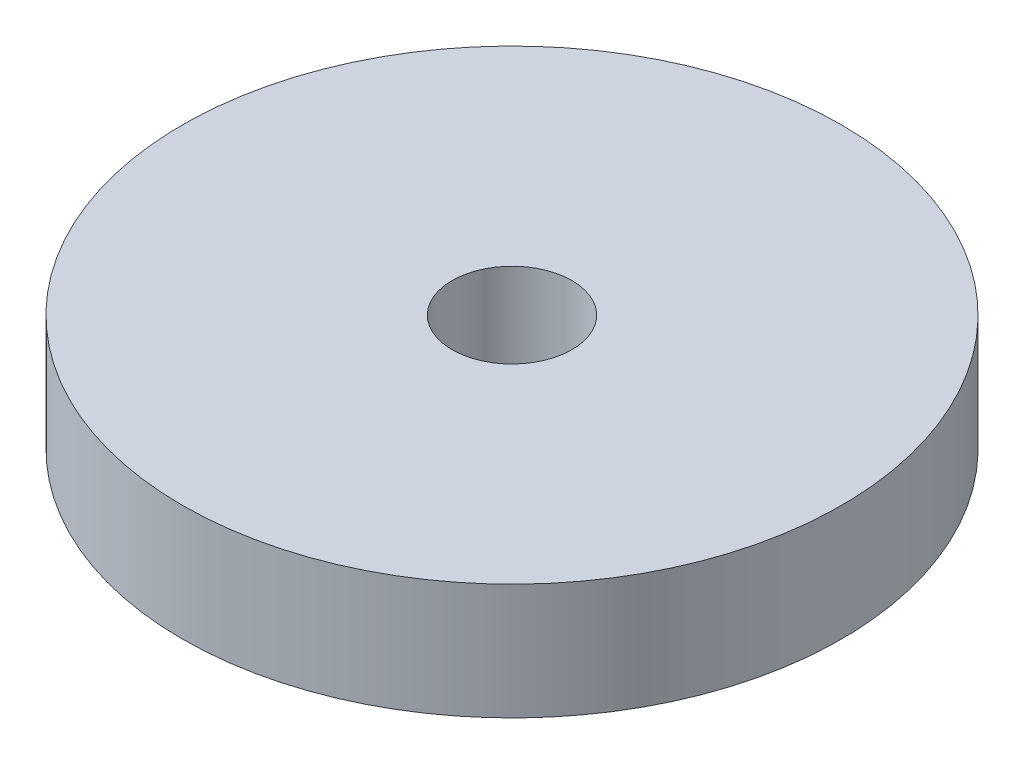
ISO-10303-21;
HEADER;
FILE_DESCRIPTION(('STEP AP214'),'2;1');
FILE_NAME('part.step','',(''),(''),'','','');
FILE_SCHEMA(('AUTOMOTIVE_DESIGN { 1 0 10303 214 1 1 1 1 }'));
ENDSEC;
DATA;
#1=APPLICATION_CONTEXT('core data for automotive mechanical design processes');
#2=APPLICATION_PROTOCOL_DEFINITION('international standard','automotive_design',2000,#1);
#3=PRODUCT_CONTEXT('',#1,'mechanical');
#4=PRODUCT('Part','Part','',(#3));
#5=PRODUCT_RELATED_PRODUCT_CATEGORY('part','',(#4));
#6=PRODUCT_DEFINITION_FORMATION('','',#4);
#7=PRODUCT_DEFINITION_CONTEXT('part definition',#1,'design');
#8=PRODUCT_DEFINITION('design','',#6,#7);
#9=PRODUCT_DEFINITION_SHAPE('','',#8);
#10=(LENGTH_UNIT() NAMED_UNIT(*) SI_UNIT(.MILLI.,.METRE.));
#11=(NAMED_UNIT(*) PLANE_ANGLE_UNIT() SI_UNIT($,.RADIAN.));
#12=(NAMED_UNIT(*) SI_UNIT($,.STERADIAN.) SOLID_ANGLE_UNIT());
#13=UNCERTAINTY_MEASURE_WITH_UNIT(LENGTH_MEASURE(1.E-05),#10,'distance_accuracy_value','');
#14=(GEOMETRIC_REPRESENTATION_CONTEXT(3) GLOBAL_UNCERTAINTY_ASSIGNED_CONTEXT((#13)) GLOBAL_UNIT_ASSIGNED_CONTEXT((#10,
#11,#12)) REPRESENTATION_CONTEXT('',''));
#15=CARTESIAN_POINT('',(0.,0.,0.));
#16=DIRECTION('',(0.,0.,1.));
#17=DIRECTION('',(1.,0.,0.));
#18=AXIS2_PLACEMENT_3D('',#15,#16,#17);
#19=CARTESIAN_POINT('',(0.,29.,0.));
#20=DIRECTION('',(0.,-1.,0.));
#21=DIRECTION('',(0.,0.,-1.));
#22=AXIS2_PLACEMENT_3D('',#19,#20,#21);
#23=CYLINDRICAL_SURFACE('',#22,82.5);
#24=CARTESIAN_POINT('',(0.,29.,0.));
#25=DIRECTION('',(0.,1.,0.));
#26=DIRECTION('',(0.,0.,1.));
#27=AXIS2_PLACEMENT_3D('',#24,#25,#26);
#28=CIRCLE('',#27,82.5);
#29=CARTESIAN_POINT('',(0.,29.,-82.5));
#30=VERTEX_POINT('',#29);
#31=EDGE_CURVE('E10',#30,#30,#28,.T.);
#32=CARTESIAN_POINT('',(0.,0.,0.));
#33=DIRECTION('',(0.,1.,0.));
#34=DIRECTION('',(0.,0.,1.));
#35=AXIS2_PLACEMENT_3D('',#32,#33,#34);
#36=CIRCLE('',#35,82.5);
#37=CARTESIAN_POINT('',(0.,0.,-82.5));
#38=VERTEX_POINT('',#37);
#39=EDGE_CURVE('E37',#38,#38,#36,.T.);
#40=CARTESIAN_POINT('',(0.,29.,-82.5));
#41=CARTESIAN_POINT('',(0.,28.6979166666667,-82.5));
#42=CARTESIAN_POINT('',(0.,28.3958333333333,-82.5));
#43=CARTESIAN_POINT('',(0.,27.7916666666667,-82.5));
#44=CARTESIAN_POINT('',(0.,27.4895833333333,-82.5));
#45=CARTESIAN_POINT('',(0.,26.8854166666667,-82.5));
#46=CARTESIAN_POINT('',(0.,26.5833333333333,-82.5));
#47=CARTESIAN_POINT('',(0.,25.9791666666667,-82.5));
#48=CARTESIAN_POINT('',(0.,25.6770833333333,-82.5));
#49=CARTESIAN_POINT('',(0.,25.0729166666667,-82.5));
#50=CARTESIAN_POINT('',(0.,24.7708333333333,-82.5));
#51=CARTESIAN_POINT('',(0.,24.1666666666667,-82.5));
#52=CARTESIAN_POINT('',(0.,23.8645833333333,-82.5));
#53=CARTESIAN_POINT('',(0.,23.2604166666667,-82.5));
#54=CARTESIAN_POINT('',(0.,22.9583333333333,-82.5));
#55=CARTESIAN_POINT('',(0.,22.3541666666667,-82.5));
#56=CARTESIAN_POINT('',(0.,22.0520833333333,-82.5));
#57=CARTESIAN_POINT('',(0.,21.4479166666667,-82.5));
#58=CARTESIAN_POINT('',(0.,21.1458333333333,-82.5));
#59=CARTESIAN_POINT('',(0.,20.5416666666667,-82.5));
#60=CARTESIAN_POINT('',(0.,20.2395833333333,-82.5));
#61=CARTESIAN_POINT('',(0.,19.6354166666667,-82.5));
#62=CARTESIAN_POINT('',(0.,19.3333333333333,-82.5));
#63=CARTESIAN_POINT('',(0.,18.7291666666667,-82.5));
#64=CARTESIAN_POINT('',(0.,18.4270833333333,-82.5));
#65=CARTESIAN_POINT('',(0.,17.8229166666667,-82.5));
#66=CARTESIAN_POINT('',(0.,17.5208333333333,-82.5));
#67=CARTESIAN_POINT('',(0.,16.9166666666667,-82.5));
#68=CARTESIAN_POINT('',(0.,16.6145833333333,-82.5));
#69=CARTESIAN_POINT('',(0.,16.0104166666667,-82.5));
#70=CARTESIAN_POINT('',(0.,15.7083333333333,-82.5));
#71=CARTESIAN_POINT('',(0.,15.1041666666667,-82.5));
#72=CARTESIAN_POINT('',(0.,14.8020833333333,-82.5));
#73=CARTESIAN_POINT('',(0.,14.1979166666667,-82.5));
#74=CARTESIAN_POINT('',(0.,13.8958333333333,-82.5));
#75=CARTESIAN_POINT('',(0.,13.2916666666667,-82.5));
#76=CARTESIAN_POINT('',(0.,12.9895833333333,-82.5));
#77=CARTESIAN_POINT('',(0.,12.3854166666667,-82.5));
#78=CARTESIAN_POINT('',(0.,12.0833333333333,-82.5));
#79=CARTESIAN_POINT('',(0.,11.4791666666667,-82.5));
#80=CARTESIAN_POINT('',(0.,11.1770833333333,-82.5));
#81=CARTESIAN_POINT('',(0.,10.5729166666667,-82.5));
#82=CARTESIAN_POINT('',(0.,10.2708333333333,-82.5));
#83=CARTESIAN_POINT('',(0.,9.66666666666667,-82.5));
#84=CARTESIAN_POINT('',(0.,9.36458333333333,-82.5));
#85=CARTESIAN_POINT('',(0.,8.76041666666667,-82.5));
#86=CARTESIAN_POINT('',(0.,8.45833333333333,-82.5));
#87=CARTESIAN_POINT('',(0.,7.85416666666667,-82.5));
#88=CARTESIAN_POINT('',(0.,7.55208333333333,-82.5));
#89=CARTESIAN_POINT('',(0.,6.94791666666667,-82.5));
#90=CARTESIAN_POINT('',(0.,6.64583333333333,-82.5));
#91=CARTESIAN_POINT('',(0.,6.04166666666667,-82.5));
#92=CARTESIAN_POINT('',(0.,5.73958333333333,-82.5));
#93=CARTESIAN_POINT('',(0.,5.13541666666667,-82.5));
#94=CARTESIAN_POINT('',(0.,4.83333333333333,-82.5));
#95=CARTESIAN_POINT('',(0.,4.22916666666667,-82.5));
#96=CARTESIAN_POINT('',(0.,3.92708333333333,-82.5));
#97=CARTESIAN_POINT('',(0.,3.32291666666667,-82.5));
#98=CARTESIAN_POINT('',(0.,3.02083333333333,-82.5));
#99=CARTESIAN_POINT('',(0.,2.41666666666667,-82.5));
#100=CARTESIAN_POINT('',(0.,2.11458333333333,-82.5));
#101=CARTESIAN_POINT('',(0.,1.51041666666667,-82.5));
#102=CARTESIAN_POINT('',(0.,1.20833333333333,-82.5));
#103=CARTESIAN_POINT('',(0.,0.604166666666667,-82.5));
#104=CARTESIAN_POINT('',(0.,0.302083333333333,-82.5));
#105=CARTESIAN_POINT('',(0.,0.,-82.5));
#106=B_SPLINE_CURVE_WITH_KNOTS('',3,(#40,#41,#42,#43,#44,#45,#46,#47,#48,#49,#50,#51,#52,#53,
#54,#55,#56,#57,#58,#59,#60,#61,#62,#63,#64,#65,#66,#67,#68,#69,#70,#71,#72,#73,#74,#75,#76,#77,
#78,#79,#80,#81,#82,#83,#84,#85,#86,#87,#88,#89,#90,#91,#92,#93,#94,#95,#96,#97,#98,#99,#100,
#101,#102,#103,#104,#105),.UNSPECIFIED.,.F.,.F.,(4,2,2,2,2,2,2,2,2,2,2,2,2,2,2,2,2,2,2,2,2,2,2,
2,2,2,2,2,2,2,2,2,4),(0.,0.906249999999997,1.8125,2.71875,3.625,4.53125,5.4375,6.34375,7.25,
8.15625,9.0625,9.96875,10.875,11.78125,12.6875,13.59375,14.5,15.40625,16.3125,17.21875,18.125,
19.03125,19.9375,20.84375,21.75,22.65625,23.5625,24.46875,25.375,26.28125,27.1875,28.09375,29.),.UNSPECIFIED.);
#107=EDGE_CURVE('BSEAM40',#30,#38,#106,.T.);
#108=ORIENTED_EDGE('',*,*,#31,.F.);
#109=ORIENTED_EDGE('',*,*,#39,.T.);
#110=ORIENTED_EDGE('',*,*,#107,.T.);
#111=ORIENTED_EDGE('',*,*,#107,.F.);
#112=EDGE_LOOP('',(#108,#110,#109,#111));
#113=FACE_BOUND('',#112,.T.);
#114=ADVANCED_FACE('F40',(#113),#23,.T.);
#115=CARTESIAN_POINT('',(0.,29.,0.));
#116=DIRECTION('',(0.,1.,0.));
#117=DIRECTION('',(0.,0.,1.));
#118=AXIS2_PLACEMENT_3D('',#115,#116,#117);
#119=PLANE('',#118);
#120=CARTESIAN_POINT('',(0.,29.,0.));
#121=DIRECTION('',(0.,1.,0.));
#122=DIRECTION('',(0.,0.,1.));
#123=AXIS2_PLACEMENT_3D('',#120,#121,#122);
#124=CIRCLE('',#123,15.);
#125=CARTESIAN_POINT('',(0.,29.,-15.));
#126=VERTEX_POINT('',#125);
#127=EDGE_CURVE('E50',#126,#126,#124,.T.);
#128=ORIENTED_EDGE('',*,*,#127,.F.);
#129=EDGE_LOOP('',(#128));
#130=FACE_BOUND('',#129,.T.);
#131=ORIENTED_EDGE('',*,*,#31,.T.);
#132=EDGE_LOOP('',(#131));
#133=FACE_BOUND('',#132,.T.);
#134=ADVANCED_FACE('F59',(#130,#133),#119,.T.);
#135=CARTESIAN_POINT('',(0.,0.,0.));
#136=DIRECTION('',(0.,1.,0.));
#137=DIRECTION('',(0.,0.,1.));
#138=AXIS2_PLACEMENT_3D('',#135,#136,#137);
#139=PLANE('',#138);
#140=CARTESIAN_POINT('',(0.,0.,0.));
#141=DIRECTION('',(0.,1.,0.));
#142=DIRECTION('',(0.,0.,1.));
#143=AXIS2_PLACEMENT_3D('',#140,#141,#142);
#144=CIRCLE('',#143,15.);
#145=CARTESIAN_POINT('',(0.,0.,-15.));
#146=VERTEX_POINT('',#145);
#147=EDGE_CURVE('E47',#146,#146,#144,.T.);
#148=ORIENTED_EDGE('',*,*,#147,.T.);
#149=EDGE_LOOP('',(#148));
#150=FACE_BOUND('',#149,.T.);
#151=ORIENTED_EDGE('',*,*,#39,.F.);
#152=EDGE_LOOP('',(#151));
#153=FACE_BOUND('',#152,.T.);
#154=ADVANCED_FACE('F58',(#150,#153),#139,.F.);
#155=CARTESIAN_POINT('',(0.,29.,0.));
#156=DIRECTION('',(0.,-1.,0.));
#157=DIRECTION('',(0.,0.,-1.));
#158=AXIS2_PLACEMENT_3D('',#155,#156,#157);
#159=CYLINDRICAL_SURFACE('',#158,15.);
#160=CARTESIAN_POINT('',(0.,29.,-15.));
#161=CARTESIAN_POINT('',(0.,28.6979166666667,-15.));
#162=CARTESIAN_POINT('',(0.,28.3958333333333,-15.));
#163=CARTESIAN_POINT('',(0.,27.7916666666667,-15.));
#164=CARTESIAN_POINT('',(0.,27.4895833333333,-15.));
#165=CARTESIAN_POINT('',(0.,26.8854166666667,-15.));
#166=CARTESIAN_POINT('',(0.,26.5833333333333,-15.));
#167=CARTESIAN_POINT('',(0.,25.9791666666667,-15.));
#168=CARTESIAN_POINT('',(0.,25.6770833333333,-15.));
#169=CARTESIAN_POINT('',(0.,25.0729166666667,-15.));
#170=CARTESIAN_POINT('',(0.,24.7708333333333,-15.));
#171=CARTESIAN_POINT('',(0.,24.1666666666667,-15.));
#172=CARTESIAN_POINT('',(0.,23.8645833333333,-15.));
#173=CARTESIAN_POINT('',(0.,23.2604166666667,-15.));
#174=CARTESIAN_POINT('',(0.,22.9583333333333,-15.));
#175=CARTESIAN_POINT('',(0.,22.3541666666667,-15.));
#176=CARTESIAN_POINT('',(0.,22.0520833333333,-15.));
#177=CARTESIAN_POINT('',(0.,21.4479166666667,-15.));
#178=CARTESIAN_POINT('',(0.,21.1458333333333,-15.));
#179=CARTESIAN_POINT('',(0.,20.5416666666667,-15.));
#180=CARTESIAN_POINT('',(0.,20.2395833333333,-15.));
#181=CARTESIAN_POINT('',(0.,19.6354166666667,-15.));
#182=CARTESIAN_POINT('',(0.,19.3333333333333,-15.));
#183=CARTESIAN_POINT('',(0.,18.7291666666667,-15.));
#184=CARTESIAN_POINT('',(0.,18.4270833333333,-15.));
#185=CARTESIAN_POINT('',(0.,17.8229166666667,-15.));
#186=CARTESIAN_POINT('',(0.,17.5208333333333,-15.));
#187=CARTESIAN_POINT('',(0.,16.9166666666667,-15.));
#188=CARTESIAN_POINT('',(0.,16.6145833333333,-15.));
#189=CARTESIAN_POINT('',(0.,16.0104166666667,-15.));
#190=CARTESIAN_POINT('',(0.,15.7083333333333,-15.));
#191=CARTESIAN_POINT('',(0.,15.1041666666667,-15.));
#192=CARTESIAN_POINT('',(0.,14.8020833333333,-15.));
#193=CARTESIAN_POINT('',(0.,14.1979166666667,-15.));
#194=CARTESIAN_POINT('',(0.,13.8958333333333,-15.));
#195=CARTESIAN_POINT('',(0.,13.2916666666667,-15.));
#196=CARTESIAN_POINT('',(0.,12.9895833333333,-15.));
#197=CARTESIAN_POINT('',(0.,12.3854166666667,-15.));
#198=CARTESIAN_POINT('',(0.,12.0833333333333,-15.));
#199=CARTESIAN_POINT('',(0.,11.4791666666667,-15.));
#200=CARTESIAN_POINT('',(0.,11.1770833333333,-15.));
#201=CARTESIAN_POINT('',(0.,10.5729166666667,-15.));
#202=CARTESIAN_POINT('',(0.,10.2708333333333,-15.));
#203=CARTESIAN_POINT('',(0.,9.66666666666667,-15.));
#204=CARTESIAN_POINT('',(0.,9.36458333333333,-15.));
#205=CARTESIAN_POINT('',(0.,8.76041666666667,-15.));
#206=CARTESIAN_POINT('',(0.,8.45833333333333,-15.));
#207=CARTESIAN_POINT('',(0.,7.85416666666667,-15.));
#208=CARTESIAN_POINT('',(0.,7.55208333333333,-15.));
#209=CARTESIAN_POINT('',(0.,6.94791666666667,-15.));
#210=CARTESIAN_POINT('',(0.,6.64583333333333,-15.));
#211=CARTESIAN_POINT('',(0.,6.04166666666667,-15.));
#212=CARTESIAN_POINT('',(0.,5.73958333333333,-15.));
#213=CARTESIAN_POINT('',(0.,5.13541666666667,-15.));
#214=CARTESIAN_POINT('',(0.,4.83333333333333,-15.));
#215=CARTESIAN_POINT('',(0.,4.22916666666667,-15.));
#216=CARTESIAN_POINT('',(0.,3.92708333333333,-15.));
#217=CARTESIAN_POINT('',(0.,3.32291666666667,-15.));
#218=CARTESIAN_POINT('',(0.,3.02083333333333,-15.));
#219=CARTESIAN_POINT('',(0.,2.41666666666667,-15.));
#220=CARTESIAN_POINT('',(0.,2.11458333333333,-15.));
#221=CARTESIAN_POINT('',(0.,1.51041666666667,-15.));
#222=CARTESIAN_POINT('',(0.,1.20833333333333,-15.));
#223=CARTESIAN_POINT('',(0.,0.604166666666667,-15.));
#224=CARTESIAN_POINT('',(0.,0.302083333333333,-15.));
#225=CARTESIAN_POINT('',(0.,0.,-15.));
#226=B_SPLINE_CURVE_WITH_KNOTS('',3,(#160,#161,#162,#163,#164,#165,#166,#167,#168,#169,#170,
#171,#172,#173,#174,#175,#176,#177,#178,#179,#180,#181,#182,#183,#184,#185,#186,#187,#188,#189,
#190,#191,#192,#193,#194,#195,#196,#197,#198,#199,#200,#201,#202,#203,#204,#205,#206,#207,#208,
#209,#210,#211,#212,#213,#214,#215,#216,#217,#218,#219,#220,#221,#222,#223,#224,#225),
.UNSPECIFIED.,.F.,.F.,(4,2,2,2,2,2,2,2,2,2,2,2,2,2,2,2,2,2,2,2,2,2,2,2,2,2,2,2,2,2,2,2,4),(0.,
0.906250000000001,1.8125,2.71875,3.625,4.53125,5.4375,6.34375,7.25,8.15625,9.0625,9.96875,
10.875,11.78125,12.6875,13.59375,14.5,15.40625,16.3125,17.21875,18.125,19.03125,19.9375,
20.84375,21.75,22.65625,23.5625,24.46875,25.375,26.28125,27.1875,28.09375,29.),.UNSPECIFIED.);
#227=EDGE_CURVE('BSEAM54',#126,#146,#226,.T.);
#228=ORIENTED_EDGE('',*,*,#127,.T.);
#229=ORIENTED_EDGE('',*,*,#147,.F.);
#230=ORIENTED_EDGE('',*,*,#227,.T.);
#231=ORIENTED_EDGE('',*,*,#227,.F.);
#232=EDGE_LOOP('',(#228,#230,#229,#231));
#233=FACE_BOUND('',#232,.T.);
#234=ADVANCED_FACE('F54',(#233),#159,.F.);
#235=CLOSED_SHELL('',(#114,#134,#154,#234));
#236=MANIFOLD_SOLID_BREP('B2',#235);
#237=ADVANCED_BREP_SHAPE_REPRESENTATION('',(#18,#236),#14);
#238=SHAPE_DEFINITION_REPRESENTATION(#9,#237);
ENDSEC;
END-ISO-10303-21;
